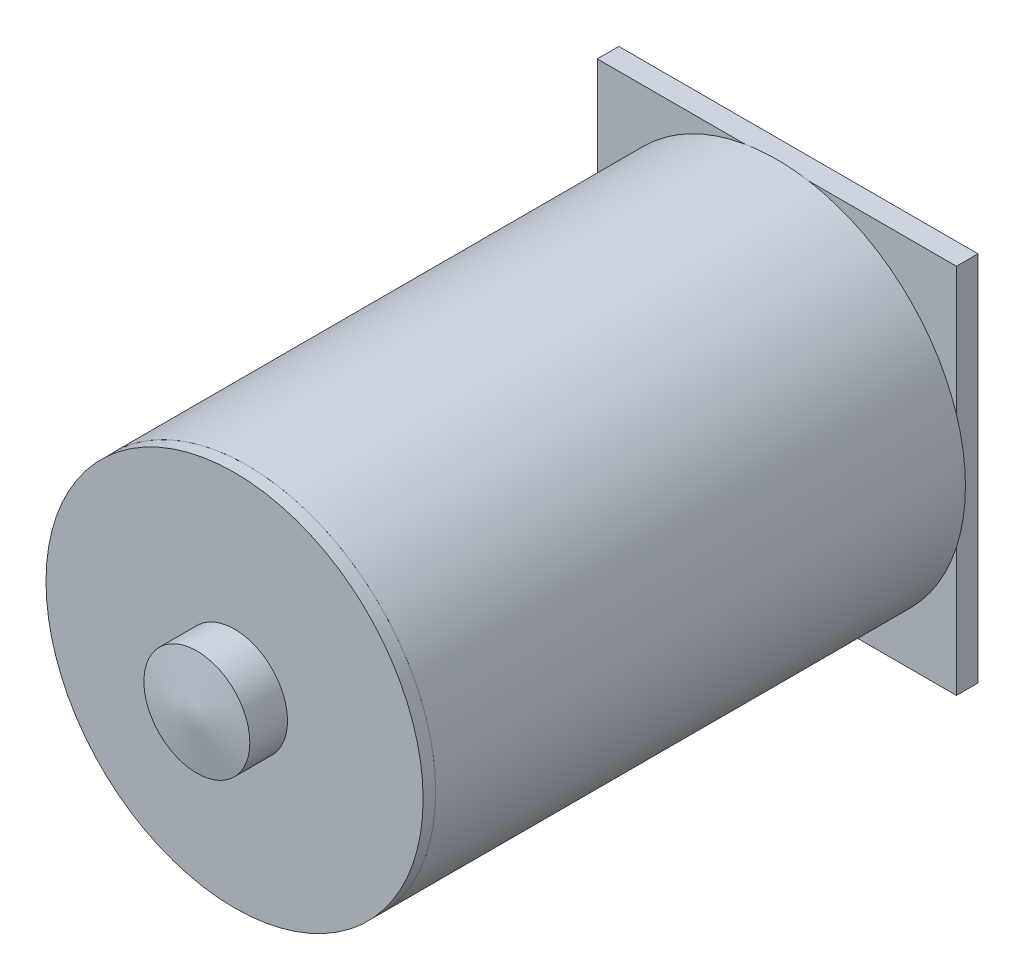
ISO-10303-21;
HEADER;
FILE_DESCRIPTION(('STEP AP214'),'2;1');
FILE_NAME('part.step','',(''),(''),'','','');
FILE_SCHEMA(('AUTOMOTIVE_DESIGN { 1 0 10303 214 1 1 1 1 }'));
ENDSEC;
DATA;
#1=APPLICATION_CONTEXT('core data for automotive mechanical design processes');
#2=APPLICATION_PROTOCOL_DEFINITION('international standard','automotive_design',2000,#1);
#3=PRODUCT_CONTEXT('',#1,'mechanical');
#4=PRODUCT('Part','Part','',(#3));
#5=PRODUCT_RELATED_PRODUCT_CATEGORY('part','',(#4));
#6=PRODUCT_DEFINITION_FORMATION('','',#4);
#7=PRODUCT_DEFINITION_CONTEXT('part definition',#1,'design');
#8=PRODUCT_DEFINITION('design','',#6,#7);
#9=PRODUCT_DEFINITION_SHAPE('','',#8);
#10=(LENGTH_UNIT() NAMED_UNIT(*) SI_UNIT(.MILLI.,.METRE.));
#11=(NAMED_UNIT(*) PLANE_ANGLE_UNIT() SI_UNIT($,.RADIAN.));
#12=(NAMED_UNIT(*) SI_UNIT($,.STERADIAN.) SOLID_ANGLE_UNIT());
#13=UNCERTAINTY_MEASURE_WITH_UNIT(LENGTH_MEASURE(1.E-05),#10,'distance_accuracy_value','');
#14=(GEOMETRIC_REPRESENTATION_CONTEXT(3) GLOBAL_UNCERTAINTY_ASSIGNED_CONTEXT((#13)) GLOBAL_UNIT_ASSIGNED_CONTEXT((#10,
#11,#12)) REPRESENTATION_CONTEXT('',''));
#15=CARTESIAN_POINT('',(0.,0.,0.));
#16=DIRECTION('',(0.,0.,1.));
#17=DIRECTION('',(1.,0.,0.));
#18=AXIS2_PLACEMENT_3D('',#15,#16,#17);
#19=CARTESIAN_POINT('',(0.,0.,30.2));
#20=DIRECTION('',(0.,0.,-1.));
#21=DIRECTION('',(-1.,0.,0.));
#22=AXIS2_PLACEMENT_3D('',#19,#20,#21);
#23=CYLINDRICAL_SURFACE('',#22,10.5);
#24=CARTESIAN_POINT('',(0.,0.,30.2));
#25=DIRECTION('',(0.,0.,1.));
#26=DIRECTION('',(1.,0.,0.));
#27=AXIS2_PLACEMENT_3D('',#24,#25,#26);
#28=CIRCLE('',#27,10.5);
#29=CARTESIAN_POINT('',(10.5,0.,30.2));
#30=VERTEX_POINT('',#29);
#31=EDGE_CURVE('E49',#30,#30,#28,.T.);
#32=ORIENTED_EDGE('',*,*,#31,.F.);
#33=EDGE_LOOP('',(#32));
#34=FACE_BOUND('',#33,.T.);
#35=CARTESIAN_POINT('',(0.,0.,29.5));
#36=DIRECTION('',(0.,0.,1.));
#37=DIRECTION('',(1.,0.,0.));
#38=AXIS2_PLACEMENT_3D('',#35,#36,#37);
#39=CIRCLE('',#38,10.5);
#40=CARTESIAN_POINT('',(10.5,0.,29.5));
#41=VERTEX_POINT('',#40);
#42=EDGE_CURVE('E45',#41,#41,#39,.T.);
#43=ORIENTED_EDGE('',*,*,#42,.T.);
#44=EDGE_LOOP('',(#43));
#45=FACE_BOUND('',#44,.T.);
#46=ADVANCED_FACE('F42',(#34,#45),#23,.T.);
#47=CARTESIAN_POINT('',(0.,0.,30.2));
#48=DIRECTION('',(0.,0.,1.));
#49=DIRECTION('',(1.,0.,0.));
#50=AXIS2_PLACEMENT_3D('',#47,#48,#49);
#51=PLANE('',#50);
#52=CARTESIAN_POINT('',(0.,0.,30.2));
#53=DIRECTION('',(0.,0.,1.));
#54=DIRECTION('',(1.,0.,0.));
#55=AXIS2_PLACEMENT_3D('',#52,#53,#54);
#56=CIRCLE('',#55,2.95);
#57=CARTESIAN_POINT('',(2.95,0.,30.2));
#58=VERTEX_POINT('',#57);
#59=EDGE_CURVE('E12',#58,#58,#56,.T.);
#60=ORIENTED_EDGE('',*,*,#59,.F.);
#61=EDGE_LOOP('',(#60));
#62=FACE_BOUND('',#61,.T.);
#63=ORIENTED_EDGE('',*,*,#31,.T.);
#64=EDGE_LOOP('',(#63));
#65=FACE_BOUND('',#64,.T.);
#66=ADVANCED_FACE('F67',(#62,#65),#51,.T.);
#67=CARTESIAN_POINT('',(0.,0.,29.5));
#68=DIRECTION('',(0.,0.,1.));
#69=DIRECTION('',(1.,0.,0.));
#70=AXIS2_PLACEMENT_3D('',#67,#68,#69);
#71=PLANE('',#70);
#72=ORIENTED_EDGE('',*,*,#42,.F.);
#73=EDGE_LOOP('',(#72));
#74=FACE_BOUND('',#73,.T.);
#75=ADVANCED_FACE('F73',(#74),#71,.F.);
#76=CARTESIAN_POINT('',(0.,0.,32.3));
#77=DIRECTION('',(0.,0.,-1.));
#78=DIRECTION('',(-1.,0.,0.));
#79=AXIS2_PLACEMENT_3D('',#76,#77,#78);
#80=CYLINDRICAL_SURFACE('',#79,2.95);
#81=CARTESIAN_POINT('',(0.,0.,32.3));
#82=DIRECTION('',(0.,0.,1.));
#83=DIRECTION('',(1.,0.,0.));
#84=AXIS2_PLACEMENT_3D('',#81,#82,#83);
#85=CIRCLE('',#84,2.95);
#86=CARTESIAN_POINT('',(2.95,0.,32.3));
#87=VERTEX_POINT('',#86);
#88=EDGE_CURVE('E60',#87,#87,#85,.T.);
#89=ORIENTED_EDGE('',*,*,#88,.F.);
#90=EDGE_LOOP('',(#89));
#91=FACE_BOUND('',#90,.T.);
#92=ORIENTED_EDGE('',*,*,#59,.T.);
#93=EDGE_LOOP('',(#92));
#94=FACE_BOUND('',#93,.T.);
#95=ADVANCED_FACE('F56',(#91,#94),#80,.T.);
#96=CARTESIAN_POINT('',(0.,0.,32.3));
#97=DIRECTION('',(0.,0.,-1.));
#98=DIRECTION('',(1.,0.,0.));
#99=AXIS2_PLACEMENT_3D('',#96,#97,#98);
#100=CONICAL_SURFACE('',#99,2.95,1.39626340159547);
#101=CARTESIAN_POINT('',(0.,0.,32.82016459309));
#102=VERTEX_POINT('',#101);
#103=VERTEX_LOOP('',#102);
#104=FACE_BOUND('',#103,.T.);
#105=ORIENTED_EDGE('',*,*,#88,.T.);
#106=EDGE_LOOP('',(#105));
#107=FACE_BOUND('',#106,.T.);
#108=ADVANCED_FACE('F53',(#104,#107),#100,.T.);
#109=CLOSED_SHELL('',(#46,#66,#75,#95,#108));
#110=MANIFOLD_SOLID_BREP('B2',#109);
#111=CARTESIAN_POINT('',(0.,0.,0.));
#112=DIRECTION('',(0.,0.,1.));
#113=DIRECTION('',(1.,0.,0.));
#114=AXIS2_PLACEMENT_3D('',#111,#112,#113);
#115=PLANE('',#114);
#116=DIRECTION('',(0.,1.,0.));
#117=VECTOR('',#116,1.);
#118=CARTESIAN_POINT('',(-10.,-10.35,0.));
#119=LINE('',#118,#117);
#120=CARTESIAN_POINT('',(-10.,-3.20156211871642,0.));
#121=VERTEX_POINT('',#120);
#122=CARTESIAN_POINT('',(-10.,3.20156211871642,0.));
#123=VERTEX_POINT('',#122);
#124=EDGE_CURVE('E40',#121,#123,#119,.T.);
#125=ORIENTED_EDGE('',*,*,#124,.F.);
#126=CARTESIAN_POINT('',(0.,0.,0.));
#127=DIRECTION('',(0.,0.,1.));
#128=DIRECTION('',(1.,0.,0.));
#129=AXIS2_PLACEMENT_3D('',#126,#127,#128);
#130=CIRCLE('',#129,10.5);
#131=EDGE_CURVE('E231',#123,#121,#130,.T.);
#132=ORIENTED_EDGE('',*,*,#131,.F.);
#133=EDGE_LOOP('',(#125,#132));
#134=FACE_BOUND('',#133,.T.);
#135=ADVANCED_FACE('F114',(#134),#115,.F.);
#136=DIRECTION('',(-1.,0.,0.));
#137=VECTOR('',#136,1.);
#138=CARTESIAN_POINT('',(10.,-10.35,0.));
#139=LINE('',#138,#137);
#140=CARTESIAN_POINT('',(1.76847391838275,-10.35,0.));
#141=VERTEX_POINT('',#140);
#142=CARTESIAN_POINT('',(-1.76847391838275,-10.35,0.));
#143=VERTEX_POINT('',#142);
#144=EDGE_CURVE('E123',#141,#143,#139,.T.);
#145=ORIENTED_EDGE('',*,*,#144,.F.);
#146=EDGE_CURVE('E236',#143,#141,#130,.T.);
#147=ORIENTED_EDGE('',*,*,#146,.F.);
#148=EDGE_LOOP('',(#145,#147));
#149=FACE_BOUND('',#148,.T.);
#150=ADVANCED_FACE('F280',(#149),#115,.F.);
#151=DIRECTION('',(0.,-1.,0.));
#152=VECTOR('',#151,1.);
#153=CARTESIAN_POINT('',(10.,-10.35,0.));
#154=LINE('',#153,#152);
#155=CARTESIAN_POINT('',(10.,3.20156211871644,0.));
#156=VERTEX_POINT('',#155);
#157=CARTESIAN_POINT('',(10.,-3.20156211871644,0.));
#158=VERTEX_POINT('',#157);
#159=EDGE_CURVE('E219',#156,#158,#154,.T.);
#160=ORIENTED_EDGE('',*,*,#159,.F.);
#161=EDGE_CURVE('E132',#158,#156,#130,.T.);
#162=ORIENTED_EDGE('',*,*,#161,.F.);
#163=EDGE_LOOP('',(#160,#162));
#164=FACE_BOUND('',#163,.T.);
#165=ADVANCED_FACE('F286',(#164),#115,.F.);
#166=DIRECTION('',(1.,0.,0.));
#167=VECTOR('',#166,1.);
#168=CARTESIAN_POINT('',(10.,10.35,0.));
#169=LINE('',#168,#167);
#170=CARTESIAN_POINT('',(-1.76847391838275,10.35,0.));
#171=VERTEX_POINT('',#170);
#172=CARTESIAN_POINT('',(1.76847391838275,10.35,0.));
#173=VERTEX_POINT('',#172);
#174=EDGE_CURVE('E215',#171,#173,#169,.T.);
#175=ORIENTED_EDGE('',*,*,#174,.F.);
#176=EDGE_CURVE('E223',#173,#171,#130,.T.);
#177=ORIENTED_EDGE('',*,*,#176,.F.);
#178=EDGE_LOOP('',(#175,#177));
#179=FACE_BOUND('',#178,.T.);
#180=ADVANCED_FACE('F282',(#179),#115,.F.);
#181=CARTESIAN_POINT('',(0.,0.,29.5));
#182=DIRECTION('',(0.,0.,-1.));
#183=DIRECTION('',(-1.,0.,0.));
#184=AXIS2_PLACEMENT_3D('',#181,#182,#183);
#185=CYLINDRICAL_SURFACE('',#184,10.5);
#186=CARTESIAN_POINT('',(0.,0.,29.5));
#187=DIRECTION('',(0.,0.,1.));
#188=DIRECTION('',(1.,0.,0.));
#189=AXIS2_PLACEMENT_3D('',#186,#187,#188);
#190=CIRCLE('',#189,10.5);
#191=CARTESIAN_POINT('',(10.5,0.,29.5));
#192=VERTEX_POINT('',#191);
#193=EDGE_CURVE('E213',#192,#192,#190,.T.);
#194=ORIENTED_EDGE('',*,*,#193,.F.);
#195=EDGE_LOOP('',(#194));
#196=FACE_BOUND('',#195,.T.);
#197=EDGE_CURVE('E118',#156,#173,#130,.T.);
#198=ORIENTED_EDGE('',*,*,#197,.T.);
#199=ORIENTED_EDGE('',*,*,#176,.T.);
#200=EDGE_CURVE('E228',#171,#123,#130,.T.);
#201=ORIENTED_EDGE('',*,*,#200,.T.);
#202=ORIENTED_EDGE('',*,*,#131,.T.);
#203=EDGE_CURVE('E233',#121,#143,#130,.T.);
#204=ORIENTED_EDGE('',*,*,#203,.T.);
#205=ORIENTED_EDGE('',*,*,#146,.T.);
#206=EDGE_CURVE('E209',#141,#158,#130,.T.);
#207=ORIENTED_EDGE('',*,*,#206,.T.);
#208=ORIENTED_EDGE('',*,*,#161,.T.);
#209=EDGE_LOOP('',(#198,#199,#201,#202,#204,#205,#207,#208));
#210=FACE_BOUND('',#209,.T.);
#211=ADVANCED_FACE('F116',(#196,#210),#185,.T.);
#212=CARTESIAN_POINT('',(0.,0.,29.5));
#213=DIRECTION('',(0.,0.,1.));
#214=DIRECTION('',(1.,0.,0.));
#215=AXIS2_PLACEMENT_3D('',#212,#213,#214);
#216=PLANE('',#215);
#217=ORIENTED_EDGE('',*,*,#193,.T.);
#218=EDGE_LOOP('',(#217));
#219=FACE_BOUND('',#218,.T.);
#220=ADVANCED_FACE('F267',(#219),#216,.T.);
#221=CARTESIAN_POINT('',(0.,0.,0.));
#222=DIRECTION('',(0.,0.,1.));
#223=DIRECTION('',(1.,0.,0.));
#224=AXIS2_PLACEMENT_3D('',#221,#222,#223);
#225=PLANE('',#224);
#226=ORIENTED_EDGE('',*,*,#197,.F.);
#227=CARTESIAN_POINT('',(10.,10.35,0.));
#228=VERTEX_POINT('',#227);
#229=EDGE_CURVE('E249',#228,#156,#154,.T.);
#230=ORIENTED_EDGE('',*,*,#229,.F.);
#231=EDGE_CURVE('E222',#173,#228,#169,.T.);
#232=ORIENTED_EDGE('',*,*,#231,.F.);
#233=EDGE_LOOP('',(#226,#230,#232));
#234=FACE_BOUND('',#233,.T.);
#235=ADVANCED_FACE('F264',(#234),#225,.T.);
#236=ORIENTED_EDGE('',*,*,#200,.F.);
#237=CARTESIAN_POINT('',(-10.,10.35,0.));
#238=VERTEX_POINT('',#237);
#239=EDGE_CURVE('E221',#238,#171,#169,.T.);
#240=ORIENTED_EDGE('',*,*,#239,.F.);
#241=EDGE_CURVE('E126',#123,#238,#119,.T.);
#242=ORIENTED_EDGE('',*,*,#241,.F.);
#243=EDGE_LOOP('',(#236,#240,#242));
#244=FACE_BOUND('',#243,.T.);
#245=ADVANCED_FACE('F266',(#244),#225,.T.);
#246=ORIENTED_EDGE('',*,*,#203,.F.);
#247=CARTESIAN_POINT('',(-10.,-10.35,0.));
#248=VERTEX_POINT('',#247);
#249=EDGE_CURVE('E125',#248,#121,#119,.T.);
#250=ORIENTED_EDGE('',*,*,#249,.F.);
#251=EDGE_CURVE('E255',#143,#248,#139,.T.);
#252=ORIENTED_EDGE('',*,*,#251,.F.);
#253=EDGE_LOOP('',(#246,#250,#252));
#254=FACE_BOUND('',#253,.T.);
#255=ADVANCED_FACE('F273',(#254),#225,.T.);
#256=ORIENTED_EDGE('',*,*,#206,.F.);
#257=CARTESIAN_POINT('',(10.,-10.35,0.));
#258=VERTEX_POINT('',#257);
#259=EDGE_CURVE('E202',#258,#141,#139,.T.);
#260=ORIENTED_EDGE('',*,*,#259,.F.);
#261=EDGE_CURVE('E243',#158,#258,#154,.T.);
#262=ORIENTED_EDGE('',*,*,#261,.F.);
#263=EDGE_LOOP('',(#256,#260,#262));
#264=FACE_BOUND('',#263,.T.);
#265=ADVANCED_FACE('F245',(#264),#225,.T.);
#266=CARTESIAN_POINT('',(-10.,-10.35,-1.2));
#267=DIRECTION('',(1.,0.,0.));
#268=DIRECTION('',(0.,0.,-1.));
#269=AXIS2_PLACEMENT_3D('',#266,#267,#268);
#270=PLANE('',#269);
#271=ORIENTED_EDGE('',*,*,#249,.T.);
#272=ORIENTED_EDGE('',*,*,#124,.T.);
#273=ORIENTED_EDGE('',*,*,#241,.T.);
#274=DIRECTION('',(0.,0.,1.));
#275=VECTOR('',#274,1.);
#276=CARTESIAN_POINT('',(-10.,10.35,-1.2));
#277=LINE('',#276,#275);
#278=CARTESIAN_POINT('',(-10.,10.35,-1.2));
#279=VERTEX_POINT('',#278);
#280=EDGE_CURVE('E187',#279,#238,#277,.T.);
#281=ORIENTED_EDGE('',*,*,#280,.F.);
#282=DIRECTION('',(0.,1.,0.));
#283=VECTOR('',#282,1.);
#284=CARTESIAN_POINT('',(-10.,-10.35,-1.2));
#285=LINE('',#284,#283);
#286=CARTESIAN_POINT('',(-10.,-10.35,-1.2));
#287=VERTEX_POINT('',#286);
#288=EDGE_CURVE('E193',#287,#279,#285,.T.);
#289=ORIENTED_EDGE('',*,*,#288,.F.);
#290=DIRECTION('',(0.,0.,1.));
#291=VECTOR('',#290,1.);
#292=CARTESIAN_POINT('',(-10.,-10.35,-1.2));
#293=LINE('',#292,#291);
#294=EDGE_CURVE('E258',#287,#248,#293,.T.);
#295=ORIENTED_EDGE('',*,*,#294,.T.);
#296=EDGE_LOOP('',(#271,#272,#273,#281,#289,#295));
#297=FACE_BOUND('',#296,.T.);
#298=ADVANCED_FACE('F205',(#297),#270,.F.);
#299=CARTESIAN_POINT('',(10.,10.35,-1.2));
#300=DIRECTION('',(0.,-1.,0.));
#301=DIRECTION('',(0.,0.,-1.));
#302=AXIS2_PLACEMENT_3D('',#299,#300,#301);
#303=PLANE('',#302);
#304=ORIENTED_EDGE('',*,*,#239,.T.);
#305=ORIENTED_EDGE('',*,*,#174,.T.);
#306=ORIENTED_EDGE('',*,*,#231,.T.);
#307=DIRECTION('',(0.,0.,1.));
#308=VECTOR('',#307,1.);
#309=CARTESIAN_POINT('',(10.,10.35,-1.2));
#310=LINE('',#309,#308);
#311=CARTESIAN_POINT('',(10.,10.35,-1.2));
#312=VERTEX_POINT('',#311);
#313=EDGE_CURVE('E189',#312,#228,#310,.T.);
#314=ORIENTED_EDGE('',*,*,#313,.F.);
#315=DIRECTION('',(1.,0.,0.));
#316=VECTOR('',#315,1.);
#317=CARTESIAN_POINT('',(10.,10.35,-1.2));
#318=LINE('',#317,#316);
#319=EDGE_CURVE('E182',#279,#312,#318,.T.);
#320=ORIENTED_EDGE('',*,*,#319,.F.);
#321=ORIENTED_EDGE('',*,*,#280,.T.);
#322=EDGE_LOOP('',(#304,#305,#306,#314,#320,#321));
#323=FACE_BOUND('',#322,.T.);
#324=ADVANCED_FACE('F185',(#323),#303,.F.);
#325=CARTESIAN_POINT('',(10.,-10.35,-1.2));
#326=DIRECTION('',(-1.,0.,0.));
#327=DIRECTION('',(0.,0.,1.));
#328=AXIS2_PLACEMENT_3D('',#325,#326,#327);
#329=PLANE('',#328);
#330=ORIENTED_EDGE('',*,*,#229,.T.);
#331=ORIENTED_EDGE('',*,*,#159,.T.);
#332=ORIENTED_EDGE('',*,*,#261,.T.);
#333=DIRECTION('',(0.,0.,1.));
#334=VECTOR('',#333,1.);
#335=CARTESIAN_POINT('',(10.,-10.35,-1.2));
#336=LINE('',#335,#334);
#337=CARTESIAN_POINT('',(10.,-10.35,-1.2));
#338=VERTEX_POINT('',#337);
#339=EDGE_CURVE('E210',#338,#258,#336,.T.);
#340=ORIENTED_EDGE('',*,*,#339,.F.);
#341=DIRECTION('',(0.,-1.,0.));
#342=VECTOR('',#341,1.);
#343=CARTESIAN_POINT('',(10.,-10.35,-1.2));
#344=LINE('',#343,#342);
#345=EDGE_CURVE('E192',#312,#338,#344,.T.);
#346=ORIENTED_EDGE('',*,*,#345,.F.);
#347=ORIENTED_EDGE('',*,*,#313,.T.);
#348=EDGE_LOOP('',(#330,#331,#332,#340,#346,#347));
#349=FACE_BOUND('',#348,.T.);
#350=ADVANCED_FACE('F252',(#349),#329,.F.);
#351=CARTESIAN_POINT('',(10.,-10.35,-1.2));
#352=DIRECTION('',(0.,1.,0.));
#353=DIRECTION('',(0.,0.,1.));
#354=AXIS2_PLACEMENT_3D('',#351,#352,#353);
#355=PLANE('',#354);
#356=ORIENTED_EDGE('',*,*,#259,.T.);
#357=ORIENTED_EDGE('',*,*,#144,.T.);
#358=ORIENTED_EDGE('',*,*,#251,.T.);
#359=ORIENTED_EDGE('',*,*,#294,.F.);
#360=DIRECTION('',(-1.,0.,0.));
#361=VECTOR('',#360,1.);
#362=CARTESIAN_POINT('',(10.,-10.35,-1.2));
#363=LINE('',#362,#361);
#364=EDGE_CURVE('E198',#338,#287,#363,.T.);
#365=ORIENTED_EDGE('',*,*,#364,.F.);
#366=ORIENTED_EDGE('',*,*,#339,.T.);
#367=EDGE_LOOP('',(#356,#357,#358,#359,#365,#366));
#368=FACE_BOUND('',#367,.T.);
#369=ADVANCED_FACE('F259',(#368),#355,.F.);
#370=CARTESIAN_POINT('',(0.,0.,-1.2));
#371=DIRECTION('',(0.,0.,1.));
#372=DIRECTION('',(1.,0.,0.));
#373=AXIS2_PLACEMENT_3D('',#370,#371,#372);
#374=PLANE('',#373);
#375=CARTESIAN_POINT('',(0.,0.,-1.2));
#376=DIRECTION('',(0.,0.,-1.));
#377=DIRECTION('',(-1.,0.,0.));
#378=AXIS2_PLACEMENT_3D('',#375,#376,#377);
#379=CIRCLE('',#378,3.85);
#380=CARTESIAN_POINT('',(-3.85,0.,-1.2));
#381=VERTEX_POINT('',#380);
#382=EDGE_CURVE('E408',#381,#381,#379,.T.);
#383=ORIENTED_EDGE('',*,*,#382,.F.);
#384=EDGE_LOOP('',(#383));
#385=FACE_BOUND('',#384,.T.);
#386=ORIENTED_EDGE('',*,*,#288,.T.);
#387=ORIENTED_EDGE('',*,*,#319,.T.);
#388=ORIENTED_EDGE('',*,*,#345,.T.);
#389=ORIENTED_EDGE('',*,*,#364,.T.);
#390=EDGE_LOOP('',(#386,#387,#388,#389));
#391=FACE_BOUND('',#390,.T.);
#392=ADVANCED_FACE('F196',(#385,#391),#374,.F.);
#393=CARTESIAN_POINT('',(0.,0.,23.8));
#394=DIRECTION('',(0.,0.,-1.));
#395=DIRECTION('',(-1.,0.,0.));
#396=AXIS2_PLACEMENT_3D('',#393,#394,#395);
#397=CYLINDRICAL_SURFACE('',#396,3.85);
#398=CARTESIAN_POINT('',(0.,0.,23.8));
#399=DIRECTION('',(0.,0.,-1.));
#400=DIRECTION('',(-1.,0.,0.));
#401=AXIS2_PLACEMENT_3D('',#398,#399,#400);
#402=CIRCLE('',#401,3.85);
#403=CARTESIAN_POINT('',(-3.85,0.,23.8));
#404=VERTEX_POINT('',#403);
#405=EDGE_CURVE('E407',#404,#404,#402,.T.);
#406=ORIENTED_EDGE('',*,*,#405,.F.);
#407=EDGE_LOOP('',(#406));
#408=FACE_BOUND('',#407,.T.);
#409=ORIENTED_EDGE('',*,*,#382,.T.);
#410=EDGE_LOOP('',(#409));
#411=FACE_BOUND('',#410,.T.);
#412=ADVANCED_FACE('F382',(#408,#411),#397,.F.);
#413=CARTESIAN_POINT('',(0.,0.,23.8));
#414=DIRECTION('',(0.,0.,-1.));
#415=DIRECTION('',(-1.,0.,0.));
#416=AXIS2_PLACEMENT_3D('',#413,#414,#415);
#417=PLANE('',#416);
#418=ORIENTED_EDGE('',*,*,#405,.T.);
#419=EDGE_LOOP('',(#418));
#420=FACE_BOUND('',#419,.T.);
#421=ADVANCED_FACE('F391',(#420),#417,.T.);
#422=CLOSED_SHELL('',(#135,#150,#165,#180,#211,#220,#235,#245,#255,#265,#298,#324,#350,#369,
#392,#412,#421));
#423=MANIFOLD_SOLID_BREP('B6',#422);
#424=ADVANCED_BREP_SHAPE_REPRESENTATION('',(#18,#110,#423),#14);
#425=SHAPE_DEFINITION_REPRESENTATION(#9,#424);
ENDSEC;
END-ISO-10303-21;
